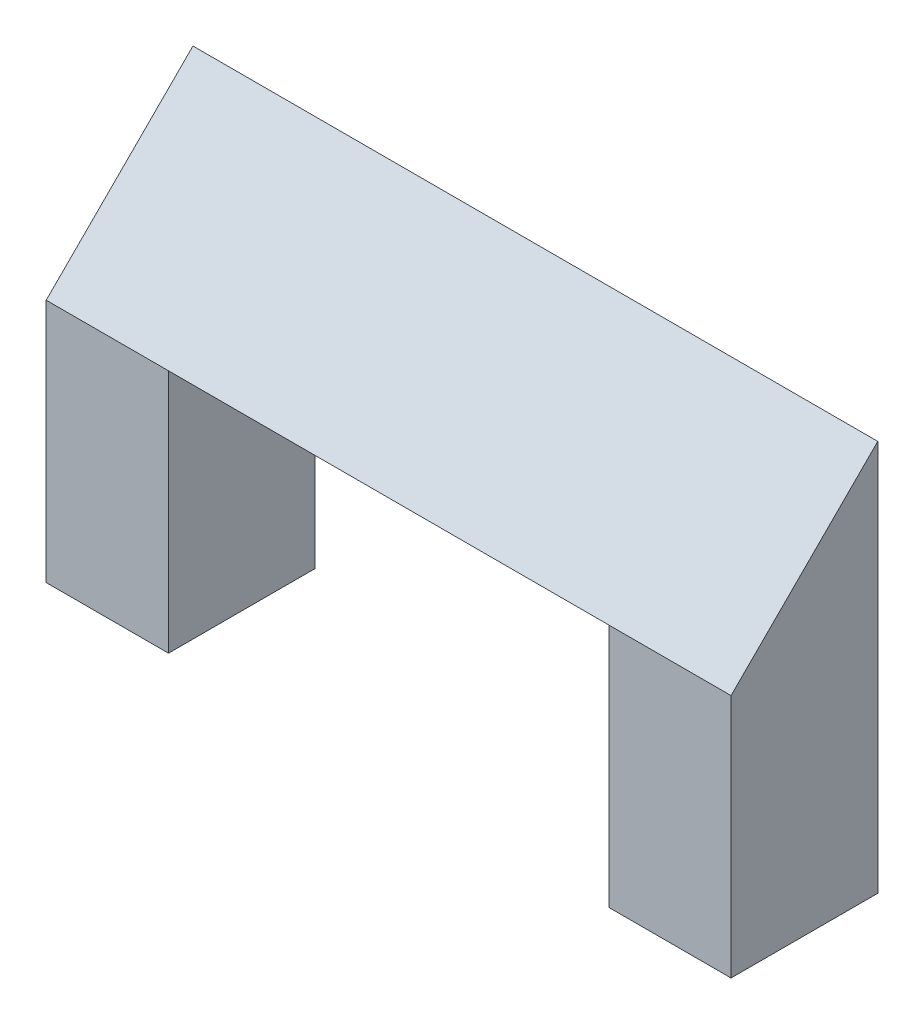
ISO-10303-21;
HEADER;
FILE_DESCRIPTION(('STEP AP214'),'2;1');
FILE_NAME('part.step','',(''),(''),'','','');
FILE_SCHEMA(('AUTOMOTIVE_DESIGN { 1 0 10303 214 1 1 1 1 }'));
ENDSEC;
DATA;
#1=APPLICATION_CONTEXT('core data for automotive mechanical design processes');
#2=APPLICATION_PROTOCOL_DEFINITION('international standard','automotive_design',2000,#1);
#3=PRODUCT_CONTEXT('',#1,'mechanical');
#4=PRODUCT('Part','Part','',(#3));
#5=PRODUCT_RELATED_PRODUCT_CATEGORY('part','',(#4));
#6=PRODUCT_DEFINITION_FORMATION('','',#4);
#7=PRODUCT_DEFINITION_CONTEXT('part definition',#1,'design');
#8=PRODUCT_DEFINITION('design','',#6,#7);
#9=PRODUCT_DEFINITION_SHAPE('','',#8);
#10=(LENGTH_UNIT() NAMED_UNIT(*) SI_UNIT(.MILLI.,.METRE.));
#11=(NAMED_UNIT(*) PLANE_ANGLE_UNIT() SI_UNIT($,.RADIAN.));
#12=(NAMED_UNIT(*) SI_UNIT($,.STERADIAN.) SOLID_ANGLE_UNIT());
#13=UNCERTAINTY_MEASURE_WITH_UNIT(LENGTH_MEASURE(1.E-05),#10,'distance_accuracy_value','');
#14=(GEOMETRIC_REPRESENTATION_CONTEXT(3) GLOBAL_UNCERTAINTY_ASSIGNED_CONTEXT((#13)) GLOBAL_UNIT_ASSIGNED_CONTEXT((#10,
#11,#12)) REPRESENTATION_CONTEXT('',''));
#15=CARTESIAN_POINT('',(0.,0.,0.));
#16=DIRECTION('',(0.,0.,1.));
#17=DIRECTION('',(1.,0.,0.));
#18=AXIS2_PLACEMENT_3D('',#15,#16,#17);
#19=CARTESIAN_POINT('',(-18.5321100917431,50.,-17.3394495412844));
#20=DIRECTION('',(-1.,0.,0.));
#21=DIRECTION('',(0.,0.,1.));
#22=AXIS2_PLACEMENT_3D('',#19,#20,#21);
#23=PLANE('',#22);
#24=DIRECTION('',(0.,-0.342020143325663,-0.939692620785911));
#25=VECTOR('',#24,1.);
#26=CARTESIAN_POINT('',(-18.5321100917431,50.,12.6605504587156));
#27=LINE('',#26,#25);
#28=CARTESIAN_POINT('',(-18.5321100917431,50.,12.6605504587156));
#29=VERTEX_POINT('',#28);
#30=CARTESIAN_POINT('',(-18.5321100917431,39.0808929720142,-17.3394495412844));
#31=VERTEX_POINT('',#30);
#32=EDGE_CURVE('E57',#29,#31,#27,.T.);
#33=ORIENTED_EDGE('',*,*,#32,.F.);
#34=DIRECTION('',(0.,-1.,0.));
#35=VECTOR('',#34,1.);
#36=CARTESIAN_POINT('',(-18.5321100917431,50.,12.6605504587156));
#37=LINE('',#36,#35);
#38=CARTESIAN_POINT('',(-18.5321100917431,0.,12.6605504587156));
#39=VERTEX_POINT('',#38);
#40=EDGE_CURVE('E45',#29,#39,#37,.T.);
#41=ORIENTED_EDGE('',*,*,#40,.T.);
#42=DIRECTION('',(0.,0.,-1.));
#43=VECTOR('',#42,1.);
#44=CARTESIAN_POINT('',(-18.5321100917431,0.,-17.3394495412844));
#45=LINE('',#44,#43);
#46=CARTESIAN_POINT('',(-18.5321100917431,0.,-17.3394495412844));
#47=VERTEX_POINT('',#46);
#48=EDGE_CURVE('E87',#39,#47,#45,.T.);
#49=ORIENTED_EDGE('',*,*,#48,.T.);
#50=DIRECTION('',(0.,-1.,0.));
#51=VECTOR('',#50,1.);
#52=CARTESIAN_POINT('',(-18.5321100917431,50.,-17.3394495412844));
#53=LINE('',#52,#51);
#54=EDGE_CURVE('E52',#31,#47,#53,.T.);
#55=ORIENTED_EDGE('',*,*,#54,.F.);
#56=EDGE_LOOP('',(#33,#41,#49,#55));
#57=FACE_BOUND('',#56,.T.);
#58=ADVANCED_FACE('F37',(#57),#23,.F.);
#59=CARTESIAN_POINT('',(71.4678899082569,50.,-17.3394495412844));
#60=DIRECTION('',(1.,0.,0.));
#61=DIRECTION('',(0.,0.,-1.));
#62=AXIS2_PLACEMENT_3D('',#59,#60,#61);
#63=PLANE('',#62);
#64=DIRECTION('',(0.,-0.342020143325663,-0.939692620785911));
#65=VECTOR('',#64,1.);
#66=CARTESIAN_POINT('',(71.4678899082569,50.,12.6605504587156));
#67=LINE('',#66,#65);
#68=CARTESIAN_POINT('',(71.4678899082569,50.,12.6605504587156));
#69=VERTEX_POINT('',#68);
#70=CARTESIAN_POINT('',(71.4678899082569,39.0808929720142,-17.3394495412844));
#71=VERTEX_POINT('',#70);
#72=EDGE_CURVE('E123',#69,#71,#67,.T.);
#73=ORIENTED_EDGE('',*,*,#72,.T.);
#74=DIRECTION('',(0.,-1.,0.));
#75=VECTOR('',#74,1.);
#76=CARTESIAN_POINT('',(71.4678899082569,50.,-17.3394495412844));
#77=LINE('',#76,#75);
#78=CARTESIAN_POINT('',(71.4678899082569,0.,-17.3394495412844));
#79=VERTEX_POINT('',#78);
#80=EDGE_CURVE('E136',#71,#79,#77,.T.);
#81=ORIENTED_EDGE('',*,*,#80,.T.);
#82=DIRECTION('',(0.,0.,1.));
#83=VECTOR('',#82,1.);
#84=CARTESIAN_POINT('',(71.4678899082569,0.,-17.3394495412844));
#85=LINE('',#84,#83);
#86=CARTESIAN_POINT('',(71.4678899082569,0.,12.6605504587156));
#87=VERTEX_POINT('',#86);
#88=EDGE_CURVE('E131',#79,#87,#85,.T.);
#89=ORIENTED_EDGE('',*,*,#88,.T.);
#90=DIRECTION('',(0.,-1.,0.));
#91=VECTOR('',#90,1.);
#92=CARTESIAN_POINT('',(71.4678899082569,50.,12.6605504587156));
#93=LINE('',#92,#91);
#94=EDGE_CURVE('E152',#69,#87,#93,.T.);
#95=ORIENTED_EDGE('',*,*,#94,.F.);
#96=EDGE_LOOP('',(#73,#81,#89,#95));
#97=FACE_BOUND('',#96,.T.);
#98=ADVANCED_FACE('F161',(#97),#63,.F.);
#99=CARTESIAN_POINT('',(-43.5321100917431,50.,-17.3394495412844));
#100=DIRECTION('',(1.,0.,0.));
#101=DIRECTION('',(0.,0.,-1.));
#102=AXIS2_PLACEMENT_3D('',#99,#100,#101);
#103=PLANE('',#102);
#104=DIRECTION('',(0.,0.,1.));
#105=VECTOR('',#104,1.);
#106=CARTESIAN_POINT('',(-43.5321100917431,0.,-17.3394495412844));
#107=LINE('',#106,#105);
#108=CARTESIAN_POINT('',(-43.5321100917431,0.,-17.3394495412844));
#109=VERTEX_POINT('',#108);
#110=CARTESIAN_POINT('',(-43.5321100917431,0.,12.6605504587156));
#111=VERTEX_POINT('',#110);
#112=EDGE_CURVE('E93',#109,#111,#107,.T.);
#113=ORIENTED_EDGE('',*,*,#112,.T.);
#114=DIRECTION('',(0.,-1.,0.));
#115=VECTOR('',#114,1.);
#116=CARTESIAN_POINT('',(-43.5321100917431,50.,12.6605504587156));
#117=LINE('',#116,#115);
#118=CARTESIAN_POINT('',(-43.5321100917431,50.,12.6605504587156));
#119=VERTEX_POINT('',#118);
#120=EDGE_CURVE('E11',#119,#111,#117,.T.);
#121=ORIENTED_EDGE('',*,*,#120,.F.);
#122=DIRECTION('',(0.,-0.707106781186544,0.707106781186551));
#123=VECTOR('',#122,1.);
#124=CARTESIAN_POINT('',(-43.5321100917431,79.9999999999997,-17.3394495412843));
#125=LINE('',#124,#123);
#126=CARTESIAN_POINT('',(-43.5321100917431,79.9999999999997,-17.3394495412843));
#127=VERTEX_POINT('',#126);
#128=EDGE_CURVE('E95',#127,#119,#125,.T.);
#129=ORIENTED_EDGE('',*,*,#128,.F.);
#130=DIRECTION('',(0.,-1.,0.));
#131=VECTOR('',#130,1.);
#132=CARTESIAN_POINT('',(-43.5321100917431,50.,-17.3394495412844));
#133=LINE('',#132,#131);
#134=EDGE_CURVE('E81',#127,#109,#133,.T.);
#135=ORIENTED_EDGE('',*,*,#134,.T.);
#136=EDGE_LOOP('',(#113,#121,#129,#135));
#137=FACE_BOUND('',#136,.T.);
#138=ADVANCED_FACE('F39',(#137),#103,.F.);
#139=CARTESIAN_POINT('',(-43.5321100917431,50.,12.6605504587156));
#140=DIRECTION('',(0.,0.,-1.));
#141=DIRECTION('',(-1.,0.,0.));
#142=AXIS2_PLACEMENT_3D('',#139,#140,#141);
#143=PLANE('',#142);
#144=DIRECTION('',(1.,0.,0.));
#145=VECTOR('',#144,1.);
#146=CARTESIAN_POINT('',(-43.5321100917431,0.,12.6605504587156));
#147=LINE('',#146,#145);
#148=EDGE_CURVE('E98',#111,#39,#147,.T.);
#149=ORIENTED_EDGE('',*,*,#148,.T.);
#150=ORIENTED_EDGE('',*,*,#40,.F.);
#151=DIRECTION('',(1.,0.,0.));
#152=VECTOR('',#151,1.);
#153=CARTESIAN_POINT('',(-43.5321100917431,50.,12.6605504587156));
#154=LINE('',#153,#152);
#155=EDGE_CURVE('E86',#119,#29,#154,.T.);
#156=ORIENTED_EDGE('',*,*,#155,.F.);
#157=ORIENTED_EDGE('',*,*,#120,.T.);
#158=EDGE_LOOP('',(#149,#150,#156,#157));
#159=FACE_BOUND('',#158,.T.);
#160=ADVANCED_FACE('F110',(#159),#143,.F.);
#161=CARTESIAN_POINT('',(-43.5321100917431,50.,-17.3394495412844));
#162=DIRECTION('',(0.,0.,1.));
#163=DIRECTION('',(1.,0.,0.));
#164=AXIS2_PLACEMENT_3D('',#161,#162,#163);
#165=PLANE('',#164);
#166=DIRECTION('',(-1.,0.,0.));
#167=VECTOR('',#166,1.);
#168=CARTESIAN_POINT('',(71.4678899082569,39.0808929720142,-17.3394495412844));
#169=LINE('',#168,#167);
#170=EDGE_CURVE('E155',#71,#31,#169,.T.);
#171=ORIENTED_EDGE('',*,*,#170,.T.);
#172=ORIENTED_EDGE('',*,*,#54,.T.);
#173=DIRECTION('',(-1.,0.,0.));
#174=VECTOR('',#173,1.);
#175=CARTESIAN_POINT('',(-43.5321100917431,0.,-17.3394495412844));
#176=LINE('',#175,#174);
#177=EDGE_CURVE('E76',#47,#109,#176,.T.);
#178=ORIENTED_EDGE('',*,*,#177,.T.);
#179=ORIENTED_EDGE('',*,*,#134,.F.);
#180=DIRECTION('',(1.,0.,0.));
#181=VECTOR('',#180,1.);
#182=CARTESIAN_POINT('',(-43.5321100917431,79.9999999999997,-17.3394495412843));
#183=LINE('',#182,#181);
#184=CARTESIAN_POINT('',(96.4678899082569,79.9999999999997,-17.3394495412844));
#185=VERTEX_POINT('',#184);
#186=EDGE_CURVE('E99',#127,#185,#183,.T.);
#187=ORIENTED_EDGE('',*,*,#186,.T.);
#188=DIRECTION('',(0.,1.,0.));
#189=VECTOR('',#188,1.);
#190=CARTESIAN_POINT('',(96.4678899082569,50.,-17.3394495412844));
#191=LINE('',#190,#189);
#192=CARTESIAN_POINT('',(96.4678899082569,0.,-17.3394495412844));
#193=VERTEX_POINT('',#192);
#194=EDGE_CURVE('E124',#193,#185,#191,.T.);
#195=ORIENTED_EDGE('',*,*,#194,.F.);
#196=DIRECTION('',(-1.,0.,0.));
#197=VECTOR('',#196,1.);
#198=CARTESIAN_POINT('',(71.4678899082569,0.,-17.3394495412844));
#199=LINE('',#198,#197);
#200=EDGE_CURVE('E135',#193,#79,#199,.T.);
#201=ORIENTED_EDGE('',*,*,#200,.T.);
#202=ORIENTED_EDGE('',*,*,#80,.F.);
#203=EDGE_LOOP('',(#171,#172,#178,#179,#187,#195,#201,#202));
#204=FACE_BOUND('',#203,.T.);
#205=ADVANCED_FACE('F79',(#204),#165,.F.);
#206=CARTESIAN_POINT('',(0.,0.,0.));
#207=DIRECTION('',(0.,1.,0.));
#208=DIRECTION('',(0.,0.,1.));
#209=AXIS2_PLACEMENT_3D('',#206,#207,#208);
#210=PLANE('',#209);
#211=ORIENTED_EDGE('',*,*,#112,.F.);
#212=ORIENTED_EDGE('',*,*,#177,.F.);
#213=ORIENTED_EDGE('',*,*,#48,.F.);
#214=ORIENTED_EDGE('',*,*,#148,.F.);
#215=EDGE_LOOP('',(#211,#212,#213,#214));
#216=FACE_BOUND('',#215,.T.);
#217=ADVANCED_FACE('F97',(#216),#210,.F.);
#218=CARTESIAN_POINT('',(-43.5321100917431,79.9999999999997,-17.3394495412843));
#219=DIRECTION('',(0.,0.707106781186551,0.707106781186544));
#220=DIRECTION('',(0.,-0.707106781186544,0.707106781186551));
#221=AXIS2_PLACEMENT_3D('',#218,#219,#220);
#222=PLANE('',#221);
#223=DIRECTION('',(0.,-0.707106781186544,0.707106781186551));
#224=VECTOR('',#223,1.);
#225=CARTESIAN_POINT('',(96.4678899082569,79.9999999999997,-17.3394495412844));
#226=LINE('',#225,#224);
#227=CARTESIAN_POINT('',(96.4678899082569,50.,12.6605504587156));
#228=VERTEX_POINT('',#227);
#229=EDGE_CURVE('E129',#185,#228,#226,.T.);
#230=ORIENTED_EDGE('',*,*,#229,.F.);
#231=ORIENTED_EDGE('',*,*,#186,.F.);
#232=ORIENTED_EDGE('',*,*,#128,.T.);
#233=ORIENTED_EDGE('',*,*,#155,.T.);
#234=DIRECTION('',(1.,0.,0.));
#235=VECTOR('',#234,1.);
#236=CARTESIAN_POINT('',(-43.5321100917431,50.,12.6605504587157));
#237=LINE('',#236,#235);
#238=EDGE_CURVE('E102',#29,#69,#237,.T.);
#239=ORIENTED_EDGE('',*,*,#238,.T.);
#240=DIRECTION('',(1.,0.,0.));
#241=VECTOR('',#240,1.);
#242=CARTESIAN_POINT('',(71.4678899082569,50.,12.6605504587156));
#243=LINE('',#242,#241);
#244=EDGE_CURVE('E133',#69,#228,#243,.T.);
#245=ORIENTED_EDGE('',*,*,#244,.T.);
#246=EDGE_LOOP('',(#230,#231,#232,#233,#239,#245));
#247=FACE_BOUND('',#246,.T.);
#248=ADVANCED_FACE('F115',(#247),#222,.T.);
#249=CARTESIAN_POINT('',(96.4678899082569,0.,0.));
#250=DIRECTION('',(1.,0.,0.));
#251=DIRECTION('',(0.,0.,-1.));
#252=AXIS2_PLACEMENT_3D('',#249,#250,#251);
#253=PLANE('',#252);
#254=ORIENTED_EDGE('',*,*,#229,.T.);
#255=DIRECTION('',(0.,-1.,0.));
#256=VECTOR('',#255,1.);
#257=CARTESIAN_POINT('',(96.4678899082569,50.,12.6605504587156));
#258=LINE('',#257,#256);
#259=CARTESIAN_POINT('',(96.4678899082569,0.,12.6605504587156));
#260=VERTEX_POINT('',#259);
#261=EDGE_CURVE('E149',#228,#260,#258,.T.);
#262=ORIENTED_EDGE('',*,*,#261,.T.);
#263=DIRECTION('',(0.,0.,-1.));
#264=VECTOR('',#263,1.);
#265=CARTESIAN_POINT('',(96.4678899082569,0.,-17.3394495412844));
#266=LINE('',#265,#264);
#267=EDGE_CURVE('E142',#260,#193,#266,.T.);
#268=ORIENTED_EDGE('',*,*,#267,.T.);
#269=ORIENTED_EDGE('',*,*,#194,.T.);
#270=EDGE_LOOP('',(#254,#262,#268,#269));
#271=FACE_BOUND('',#270,.T.);
#272=ADVANCED_FACE('F189',(#271),#253,.T.);
#273=CARTESIAN_POINT('',(71.4678899082569,50.,12.6605504587156));
#274=DIRECTION('',(0.,0.,-1.));
#275=DIRECTION('',(-1.,0.,0.));
#276=AXIS2_PLACEMENT_3D('',#273,#274,#275);
#277=PLANE('',#276);
#278=DIRECTION('',(1.,0.,0.));
#279=VECTOR('',#278,1.);
#280=CARTESIAN_POINT('',(71.4678899082569,0.,12.6605504587156));
#281=LINE('',#280,#279);
#282=EDGE_CURVE('E139',#87,#260,#281,.T.);
#283=ORIENTED_EDGE('',*,*,#282,.T.);
#284=ORIENTED_EDGE('',*,*,#261,.F.);
#285=ORIENTED_EDGE('',*,*,#244,.F.);
#286=ORIENTED_EDGE('',*,*,#94,.T.);
#287=EDGE_LOOP('',(#283,#284,#285,#286));
#288=FACE_BOUND('',#287,.T.);
#289=ADVANCED_FACE('F187',(#288),#277,.F.);
#290=CARTESIAN_POINT('',(0.,0.,0.));
#291=DIRECTION('',(0.,1.,0.));
#292=DIRECTION('',(0.,0.,1.));
#293=AXIS2_PLACEMENT_3D('',#290,#291,#292);
#294=PLANE('',#293);
#295=ORIENTED_EDGE('',*,*,#88,.F.);
#296=ORIENTED_EDGE('',*,*,#200,.F.);
#297=ORIENTED_EDGE('',*,*,#267,.F.);
#298=ORIENTED_EDGE('',*,*,#282,.F.);
#299=EDGE_LOOP('',(#295,#296,#297,#298));
#300=FACE_BOUND('',#299,.T.);
#301=ADVANCED_FACE('F174',(#300),#294,.F.);
#302=CARTESIAN_POINT('',(71.4678899082569,50.,12.6605504587156));
#303=DIRECTION('',(0.,0.939692620785911,-0.342020143325663));
#304=DIRECTION('',(0.,0.342020143325663,0.939692620785911));
#305=AXIS2_PLACEMENT_3D('',#302,#303,#304);
#306=PLANE('',#305);
#307=ORIENTED_EDGE('',*,*,#32,.T.);
#308=ORIENTED_EDGE('',*,*,#170,.F.);
#309=ORIENTED_EDGE('',*,*,#72,.F.);
#310=ORIENTED_EDGE('',*,*,#238,.F.);
#311=EDGE_LOOP('',(#307,#308,#309,#310));
#312=FACE_BOUND('',#311,.T.);
#313=ADVANCED_FACE('F120',(#312),#306,.F.);
#314=CLOSED_SHELL('',(#58,#98,#138,#160,#205,#217,#248,#272,#289,#301,#313));
#315=MANIFOLD_SOLID_BREP('B2',#314);
#316=ADVANCED_BREP_SHAPE_REPRESENTATION('',(#18,#315),#14);
#317=SHAPE_DEFINITION_REPRESENTATION(#9,#316);
ENDSEC;
END-ISO-10303-21;
